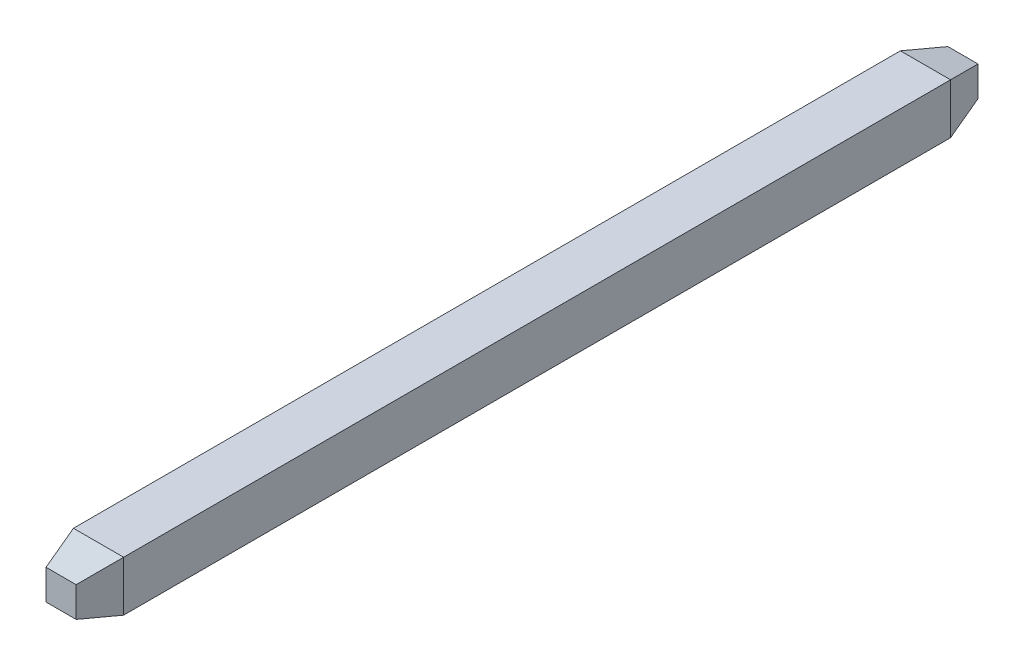
ISO-10303-21;
HEADER;
FILE_DESCRIPTION(('STEP AP214'),'2;1');
FILE_NAME('part.step','',(''),(''),'','','');
FILE_SCHEMA(('AUTOMOTIVE_DESIGN { 1 0 10303 214 1 1 1 1 }'));
ENDSEC;
DATA;
#1=APPLICATION_CONTEXT('core data for automotive mechanical design processes');
#2=APPLICATION_PROTOCOL_DEFINITION('international standard','automotive_design',2000,#1);
#3=PRODUCT_CONTEXT('',#1,'mechanical');
#4=PRODUCT('Part','Part','',(#3));
#5=PRODUCT_RELATED_PRODUCT_CATEGORY('part','',(#4));
#6=PRODUCT_DEFINITION_FORMATION('','',#4);
#7=PRODUCT_DEFINITION_CONTEXT('part definition',#1,'design');
#8=PRODUCT_DEFINITION('design','',#6,#7);
#9=PRODUCT_DEFINITION_SHAPE('','',#8);
#10=(LENGTH_UNIT() NAMED_UNIT(*) SI_UNIT(.MILLI.,.METRE.));
#11=(NAMED_UNIT(*) PLANE_ANGLE_UNIT() SI_UNIT($,.RADIAN.));
#12=(NAMED_UNIT(*) SI_UNIT($,.STERADIAN.) SOLID_ANGLE_UNIT());
#13=UNCERTAINTY_MEASURE_WITH_UNIT(LENGTH_MEASURE(1.E-05),#10,'distance_accuracy_value','');
#14=(GEOMETRIC_REPRESENTATION_CONTEXT(3) GLOBAL_UNCERTAINTY_ASSIGNED_CONTEXT((#13)) GLOBAL_UNIT_ASSIGNED_CONTEXT((#10,
#11,#12)) REPRESENTATION_CONTEXT('',''));
#15=CARTESIAN_POINT('',(0.,0.,0.));
#16=DIRECTION('',(0.,0.,1.));
#17=DIRECTION('',(1.,0.,0.));
#18=AXIS2_PLACEMENT_3D('',#15,#16,#17);
#19=CARTESIAN_POINT('',(2.86,1.00859499326234,7.92229749663118));
#20=DIRECTION('',(0.965925826289069,0.,0.25881904510252));
#21=DIRECTION('',(0.25881904510252,0.,-0.965925826289069));
#22=AXIS2_PLACEMENT_3D('',#19,#20,#21);
#23=PLANE('',#22);
#24=DIRECTION('',(0.,1.,0.));
#25=VECTOR('',#24,1.);
#26=CARTESIAN_POINT('',(2.732,2.53999999999997,8.4));
#27=LINE('',#26,#25);
#28=CARTESIAN_POINT('',(2.732,2.34799999999997,8.4));
#29=VERTEX_POINT('',#28);
#30=CARTESIAN_POINT('',(2.732,2.73199999999997,8.4));
#31=VERTEX_POINT('',#30);
#32=EDGE_CURVE('E20',#29,#31,#27,.T.);
#33=ORIENTED_EDGE('',*,*,#32,.F.);
#34=DIRECTION('',(-0.25056280708573,0.250562807085731,0.93511312653103));
#35=VECTOR('',#34,1.);
#36=CARTESIAN_POINT('',(2.86,2.21999999999997,7.92229749663118));
#37=LINE('',#36,#35);
#38=CARTESIAN_POINT('',(2.86,2.21999999999997,7.92229749663118));
#39=VERTEX_POINT('',#38);
#40=EDGE_CURVE('E110',#39,#29,#37,.T.);
#41=ORIENTED_EDGE('',*,*,#40,.F.);
#42=DIRECTION('',(0.,1.,0.));
#43=VECTOR('',#42,1.);
#44=CARTESIAN_POINT('',(2.86,2.21999999999997,7.92229749663118));
#45=LINE('',#44,#43);
#46=CARTESIAN_POINT('',(2.86,2.85999999999997,7.92229749663118));
#47=VERTEX_POINT('',#46);
#48=EDGE_CURVE('E96',#47,#39,#45,.F.);
#49=ORIENTED_EDGE('',*,*,#48,.F.);
#50=DIRECTION('',(0.25056280708573,0.250562807085731,-0.93511312653103));
#51=VECTOR('',#50,1.);
#52=CARTESIAN_POINT('',(2.732,2.73199999999997,8.4));
#53=LINE('',#52,#51);
#54=EDGE_CURVE('E94',#31,#47,#53,.T.);
#55=ORIENTED_EDGE('',*,*,#54,.F.);
#56=EDGE_LOOP('',(#33,#41,#49,#55));
#57=FACE_BOUND('',#56,.T.);
#58=ADVANCED_FACE('F17',(#57),#23,.T.);
#59=CARTESIAN_POINT('',(2.86,1.00859499326234,-2.62229749663118));
#60=DIRECTION('',(-0.965925826289068,0.,0.258819045102521));
#61=DIRECTION('',(0.258819045102521,0.,0.965925826289068));
#62=AXIS2_PLACEMENT_3D('',#59,#60,#61);
#63=PLANE('',#62);
#64=DIRECTION('',(-0.25056280708573,0.250562807085732,-0.93511312653103));
#65=VECTOR('',#64,1.);
#66=CARTESIAN_POINT('',(2.86,2.21999999999997,-2.62229749663118));
#67=LINE('',#66,#65);
#68=CARTESIAN_POINT('',(2.86,2.21999999999997,-2.62229749663118));
#69=VERTEX_POINT('',#68);
#70=CARTESIAN_POINT('',(2.732,2.34799999999997,-3.1));
#71=VERTEX_POINT('',#70);
#72=EDGE_CURVE('E113',#69,#71,#67,.T.);
#73=ORIENTED_EDGE('',*,*,#72,.T.);
#74=DIRECTION('',(0.,1.,0.));
#75=VECTOR('',#74,1.);
#76=CARTESIAN_POINT('',(2.732,2.53999999999997,-3.1));
#77=LINE('',#76,#75);
#78=CARTESIAN_POINT('',(2.732,2.73199999999997,-3.1));
#79=VERTEX_POINT('',#78);
#80=EDGE_CURVE('E79',#71,#79,#77,.T.);
#81=ORIENTED_EDGE('',*,*,#80,.T.);
#82=DIRECTION('',(0.25056280708573,0.250562807085732,0.93511312653103));
#83=VECTOR('',#82,1.);
#84=CARTESIAN_POINT('',(2.732,2.73199999999997,-3.1));
#85=LINE('',#84,#83);
#86=CARTESIAN_POINT('',(2.86,2.85999999999997,-2.62229749663118));
#87=VERTEX_POINT('',#86);
#88=EDGE_CURVE('E108',#79,#87,#85,.T.);
#89=ORIENTED_EDGE('',*,*,#88,.T.);
#90=DIRECTION('',(0.,1.,0.));
#91=VECTOR('',#90,1.);
#92=CARTESIAN_POINT('',(2.86,2.21999999999997,-2.62229749663118));
#93=LINE('',#92,#91);
#94=EDGE_CURVE('E118',#69,#87,#93,.T.);
#95=ORIENTED_EDGE('',*,*,#94,.F.);
#96=EDGE_LOOP('',(#73,#81,#89,#95));
#97=FACE_BOUND('',#96,.T.);
#98=ADVANCED_FACE('F281',(#97),#63,.F.);
#99=CARTESIAN_POINT('',(2.54,2.53999999999997,8.4));
#100=DIRECTION('',(0.,0.,1.));
#101=DIRECTION('',(1.,0.,0.));
#102=AXIS2_PLACEMENT_3D('',#99,#100,#101);
#103=PLANE('',#102);
#104=DIRECTION('',(1.,0.,0.));
#105=VECTOR('',#104,1.);
#106=CARTESIAN_POINT('',(1.00859499326237,2.34799999999997,8.4));
#107=LINE('',#106,#105);
#108=CARTESIAN_POINT('',(2.348,2.34799999999997,8.4));
#109=VERTEX_POINT('',#108);
#110=EDGE_CURVE('E90',#29,#109,#107,.F.);
#111=ORIENTED_EDGE('',*,*,#110,.F.);
#112=ORIENTED_EDGE('',*,*,#32,.T.);
#113=DIRECTION('',(1.,0.,0.));
#114=VECTOR('',#113,1.);
#115=CARTESIAN_POINT('',(4.07140500673763,2.73199999999997,8.4));
#116=LINE('',#115,#114);
#117=CARTESIAN_POINT('',(2.348,2.73199999999997,8.4));
#118=VERTEX_POINT('',#117);
#119=EDGE_CURVE('E88',#118,#31,#116,.T.);
#120=ORIENTED_EDGE('',*,*,#119,.F.);
#121=DIRECTION('',(0.,1.,0.));
#122=VECTOR('',#121,1.);
#123=CARTESIAN_POINT('',(2.348,4.0714050067376,8.4));
#124=LINE('',#123,#122);
#125=EDGE_CURVE('E124',#109,#118,#124,.T.);
#126=ORIENTED_EDGE('',*,*,#125,.F.);
#127=EDGE_LOOP('',(#111,#112,#120,#126));
#128=FACE_BOUND('',#127,.T.);
#129=ADVANCED_FACE('F85',(#128),#103,.T.);
#130=CARTESIAN_POINT('',(4.07140500673763,2.85999999999997,7.92229749663118));
#131=DIRECTION('',(0.,0.965925826289069,0.25881904510252));
#132=DIRECTION('',(0.,-0.25881904510252,0.965925826289069));
#133=AXIS2_PLACEMENT_3D('',#130,#131,#132);
#134=PLANE('',#133);
#135=ORIENTED_EDGE('',*,*,#119,.T.);
#136=ORIENTED_EDGE('',*,*,#54,.T.);
#137=DIRECTION('',(-1.,0.,0.));
#138=VECTOR('',#137,1.);
#139=CARTESIAN_POINT('',(2.86,2.85999999999997,7.92229749663118));
#140=LINE('',#139,#138);
#141=CARTESIAN_POINT('',(2.22,2.85999999999997,7.92229749663118));
#142=VERTEX_POINT('',#141);
#143=EDGE_CURVE('E127',#142,#47,#140,.F.);
#144=ORIENTED_EDGE('',*,*,#143,.F.);
#145=DIRECTION('',(-0.250562807085731,0.25056280708573,-0.93511312653103));
#146=VECTOR('',#145,1.);
#147=CARTESIAN_POINT('',(2.348,2.73199999999997,8.4));
#148=LINE('',#147,#146);
#149=EDGE_CURVE('E102',#118,#142,#148,.T.);
#150=ORIENTED_EDGE('',*,*,#149,.F.);
#151=EDGE_LOOP('',(#135,#136,#144,#150));
#152=FACE_BOUND('',#151,.T.);
#153=ADVANCED_FACE('F100',(#152),#134,.T.);
#154=CARTESIAN_POINT('',(2.54,2.53999999999997,-3.1));
#155=DIRECTION('',(0.,0.,1.));
#156=DIRECTION('',(1.,0.,0.));
#157=AXIS2_PLACEMENT_3D('',#154,#155,#156);
#158=PLANE('',#157);
#159=ORIENTED_EDGE('',*,*,#80,.F.);
#160=DIRECTION('',(1.,0.,0.));
#161=VECTOR('',#160,1.);
#162=CARTESIAN_POINT('',(1.00859499326237,2.34799999999997,-3.1));
#163=LINE('',#162,#161);
#164=CARTESIAN_POINT('',(2.348,2.34799999999997,-3.1));
#165=VERTEX_POINT('',#164);
#166=EDGE_CURVE('E115',#71,#165,#163,.F.);
#167=ORIENTED_EDGE('',*,*,#166,.T.);
#168=DIRECTION('',(0.,1.,0.));
#169=VECTOR('',#168,1.);
#170=CARTESIAN_POINT('',(2.348,4.0714050067376,-3.1));
#171=LINE('',#170,#169);
#172=CARTESIAN_POINT('',(2.348,2.73199999999997,-3.1));
#173=VERTEX_POINT('',#172);
#174=EDGE_CURVE('E138',#165,#173,#171,.T.);
#175=ORIENTED_EDGE('',*,*,#174,.T.);
#176=DIRECTION('',(1.,0.,0.));
#177=VECTOR('',#176,1.);
#178=CARTESIAN_POINT('',(4.07140500673763,2.73199999999997,-3.1));
#179=LINE('',#178,#177);
#180=EDGE_CURVE('E106',#173,#79,#179,.T.);
#181=ORIENTED_EDGE('',*,*,#180,.T.);
#182=EDGE_LOOP('',(#159,#167,#175,#181));
#183=FACE_BOUND('',#182,.T.);
#184=ADVANCED_FACE('F257',(#183),#158,.F.);
#185=CARTESIAN_POINT('',(4.07140500673763,2.85999999999997,-2.62229749663118));
#186=DIRECTION('',(0.,-0.965925826289068,0.258819045102521));
#187=DIRECTION('',(0.,-0.258819045102521,-0.965925826289068));
#188=AXIS2_PLACEMENT_3D('',#185,#186,#187);
#189=PLANE('',#188);
#190=ORIENTED_EDGE('',*,*,#88,.F.);
#191=ORIENTED_EDGE('',*,*,#180,.F.);
#192=DIRECTION('',(-0.250562807085732,0.25056280708573,0.93511312653103));
#193=VECTOR('',#192,1.);
#194=CARTESIAN_POINT('',(2.348,2.73199999999997,-3.1));
#195=LINE('',#194,#193);
#196=CARTESIAN_POINT('',(2.22,2.85999999999997,-2.62229749663118));
#197=VERTEX_POINT('',#196);
#198=EDGE_CURVE('E140',#173,#197,#195,.T.);
#199=ORIENTED_EDGE('',*,*,#198,.T.);
#200=DIRECTION('',(-1.,0.,0.));
#201=VECTOR('',#200,1.);
#202=CARTESIAN_POINT('',(2.86,2.85999999999997,-2.62229749663118));
#203=LINE('',#202,#201);
#204=EDGE_CURVE('E133',#87,#197,#203,.T.);
#205=ORIENTED_EDGE('',*,*,#204,.F.);
#206=EDGE_LOOP('',(#190,#191,#199,#205));
#207=FACE_BOUND('',#206,.T.);
#208=ADVANCED_FACE('F249',(#207),#189,.F.);
#209=CARTESIAN_POINT('',(1.00859499326237,2.21999999999997,7.92229749663118));
#210=DIRECTION('',(0.,-0.965925826289069,0.25881904510252));
#211=DIRECTION('',(0.,-0.25881904510252,-0.965925826289069));
#212=AXIS2_PLACEMENT_3D('',#209,#210,#211);
#213=PLANE('',#212);
#214=ORIENTED_EDGE('',*,*,#110,.T.);
#215=DIRECTION('',(0.250562807085731,0.25056280708573,0.93511312653103));
#216=VECTOR('',#215,1.);
#217=CARTESIAN_POINT('',(2.22,2.21999999999997,7.92229749663118));
#218=LINE('',#217,#216);
#219=CARTESIAN_POINT('',(2.22,2.21999999999997,7.92229749663118));
#220=VERTEX_POINT('',#219);
#221=EDGE_CURVE('E121',#220,#109,#218,.T.);
#222=ORIENTED_EDGE('',*,*,#221,.F.);
#223=DIRECTION('',(1.,0.,0.));
#224=VECTOR('',#223,1.);
#225=CARTESIAN_POINT('',(2.22,2.21999999999997,7.92229749663118));
#226=LINE('',#225,#224);
#227=EDGE_CURVE('E142',#39,#220,#226,.F.);
#228=ORIENTED_EDGE('',*,*,#227,.F.);
#229=ORIENTED_EDGE('',*,*,#40,.T.);
#230=EDGE_LOOP('',(#214,#222,#228,#229));
#231=FACE_BOUND('',#230,.T.);
#232=ADVANCED_FACE('F171',(#231),#213,.T.);
#233=CARTESIAN_POINT('',(1.00859499326237,2.21999999999997,-2.62229749663118));
#234=DIRECTION('',(0.,0.965925826289068,0.258819045102521));
#235=DIRECTION('',(0.,-0.258819045102521,0.965925826289068));
#236=AXIS2_PLACEMENT_3D('',#233,#234,#235);
#237=PLANE('',#236);
#238=DIRECTION('',(0.250562807085732,0.250562807085731,-0.935113126531029));
#239=VECTOR('',#238,1.);
#240=CARTESIAN_POINT('',(2.22,2.21999999999997,-2.62229749663118));
#241=LINE('',#240,#239);
#242=CARTESIAN_POINT('',(2.22,2.21999999999997,-2.62229749663118));
#243=VERTEX_POINT('',#242);
#244=EDGE_CURVE('E136',#243,#165,#241,.T.);
#245=ORIENTED_EDGE('',*,*,#244,.T.);
#246=ORIENTED_EDGE('',*,*,#166,.F.);
#247=ORIENTED_EDGE('',*,*,#72,.F.);
#248=DIRECTION('',(1.,0.,0.));
#249=VECTOR('',#248,1.);
#250=CARTESIAN_POINT('',(2.22,2.21999999999997,-2.62229749663118));
#251=LINE('',#250,#249);
#252=EDGE_CURVE('E35',#243,#69,#251,.T.);
#253=ORIENTED_EDGE('',*,*,#252,.F.);
#254=EDGE_LOOP('',(#245,#246,#247,#253));
#255=FACE_BOUND('',#254,.T.);
#256=ADVANCED_FACE('F188',(#255),#237,.F.);
#257=CARTESIAN_POINT('',(2.86,2.21999999999997,-3.1));
#258=DIRECTION('',(1.,0.,0.));
#259=DIRECTION('',(0.,1.,0.));
#260=AXIS2_PLACEMENT_3D('',#257,#258,#259);
#261=PLANE('',#260);
#262=ORIENTED_EDGE('',*,*,#94,.T.);
#263=DIRECTION('',(0.,0.,1.));
#264=VECTOR('',#263,1.);
#265=CARTESIAN_POINT('',(2.86,2.85999999999997,-3.1));
#266=LINE('',#265,#264);
#267=EDGE_CURVE('E130',#47,#87,#266,.F.);
#268=ORIENTED_EDGE('',*,*,#267,.F.);
#269=ORIENTED_EDGE('',*,*,#48,.T.);
#270=DIRECTION('',(0.,0.,1.));
#271=VECTOR('',#270,1.);
#272=CARTESIAN_POINT('',(2.86,2.21999999999997,-3.1));
#273=LINE('',#272,#271);
#274=EDGE_CURVE('E146',#69,#39,#273,.T.);
#275=ORIENTED_EDGE('',*,*,#274,.F.);
#276=EDGE_LOOP('',(#262,#268,#269,#275));
#277=FACE_BOUND('',#276,.T.);
#278=ADVANCED_FACE('F174',(#277),#261,.T.);
#279=CARTESIAN_POINT('',(2.22,4.0714050067376,7.92229749663118));
#280=DIRECTION('',(-0.965925826289069,0.,0.25881904510252));
#281=DIRECTION('',(0.25881904510252,0.,0.965925826289069));
#282=AXIS2_PLACEMENT_3D('',#279,#280,#281);
#283=PLANE('',#282);
#284=ORIENTED_EDGE('',*,*,#125,.T.);
#285=ORIENTED_EDGE('',*,*,#149,.T.);
#286=DIRECTION('',(0.,-1.,0.));
#287=VECTOR('',#286,1.);
#288=CARTESIAN_POINT('',(2.22,2.85999999999997,7.92229749663118));
#289=LINE('',#288,#287);
#290=EDGE_CURVE('E149',#220,#142,#289,.F.);
#291=ORIENTED_EDGE('',*,*,#290,.F.);
#292=ORIENTED_EDGE('',*,*,#221,.T.);
#293=EDGE_LOOP('',(#284,#285,#291,#292));
#294=FACE_BOUND('',#293,.T.);
#295=ADVANCED_FACE('F179',(#294),#283,.T.);
#296=CARTESIAN_POINT('',(2.86,2.85999999999997,-3.1));
#297=DIRECTION('',(0.,1.,0.));
#298=DIRECTION('',(-1.,0.,0.));
#299=AXIS2_PLACEMENT_3D('',#296,#297,#298);
#300=PLANE('',#299);
#301=ORIENTED_EDGE('',*,*,#204,.T.);
#302=DIRECTION('',(0.,0.,1.));
#303=VECTOR('',#302,1.);
#304=CARTESIAN_POINT('',(2.22,2.85999999999997,-3.1));
#305=LINE('',#304,#303);
#306=EDGE_CURVE('E152',#142,#197,#305,.F.);
#307=ORIENTED_EDGE('',*,*,#306,.F.);
#308=ORIENTED_EDGE('',*,*,#143,.T.);
#309=ORIENTED_EDGE('',*,*,#267,.T.);
#310=EDGE_LOOP('',(#301,#307,#308,#309));
#311=FACE_BOUND('',#310,.T.);
#312=ADVANCED_FACE('F177',(#311),#300,.T.);
#313=CARTESIAN_POINT('',(2.22,4.0714050067376,-2.62229749663118));
#314=DIRECTION('',(0.965925826289068,0.,0.258819045102521));
#315=DIRECTION('',(0.258819045102521,0.,-0.965925826289068));
#316=AXIS2_PLACEMENT_3D('',#313,#314,#315);
#317=PLANE('',#316);
#318=ORIENTED_EDGE('',*,*,#198,.F.);
#319=ORIENTED_EDGE('',*,*,#174,.F.);
#320=ORIENTED_EDGE('',*,*,#244,.F.);
#321=DIRECTION('',(0.,-1.,0.));
#322=VECTOR('',#321,1.);
#323=CARTESIAN_POINT('',(2.22,2.85999999999997,-2.62229749663118));
#324=LINE('',#323,#322);
#325=EDGE_CURVE('E26',#197,#243,#324,.T.);
#326=ORIENTED_EDGE('',*,*,#325,.F.);
#327=EDGE_LOOP('',(#318,#319,#320,#326));
#328=FACE_BOUND('',#327,.T.);
#329=ADVANCED_FACE('F163',(#328),#317,.F.);
#330=CARTESIAN_POINT('',(2.22,2.21999999999997,-3.1));
#331=DIRECTION('',(0.,-1.,0.));
#332=DIRECTION('',(1.,0.,0.));
#333=AXIS2_PLACEMENT_3D('',#330,#331,#332);
#334=PLANE('',#333);
#335=ORIENTED_EDGE('',*,*,#252,.T.);
#336=ORIENTED_EDGE('',*,*,#274,.T.);
#337=ORIENTED_EDGE('',*,*,#227,.T.);
#338=DIRECTION('',(0.,0.,1.));
#339=VECTOR('',#338,1.);
#340=CARTESIAN_POINT('',(2.22,2.21999999999997,-3.1));
#341=LINE('',#340,#339);
#342=EDGE_CURVE('E11',#243,#220,#341,.T.);
#343=ORIENTED_EDGE('',*,*,#342,.F.);
#344=EDGE_LOOP('',(#335,#336,#337,#343));
#345=FACE_BOUND('',#344,.T.);
#346=ADVANCED_FACE('F167',(#345),#334,.T.);
#347=CARTESIAN_POINT('',(2.22,2.85999999999997,-3.1));
#348=DIRECTION('',(-1.,0.,0.));
#349=DIRECTION('',(0.,-1.,0.));
#350=AXIS2_PLACEMENT_3D('',#347,#348,#349);
#351=PLANE('',#350);
#352=ORIENTED_EDGE('',*,*,#325,.T.);
#353=ORIENTED_EDGE('',*,*,#342,.T.);
#354=ORIENTED_EDGE('',*,*,#290,.T.);
#355=ORIENTED_EDGE('',*,*,#306,.T.);
#356=EDGE_LOOP('',(#352,#353,#354,#355));
#357=FACE_BOUND('',#356,.T.);
#358=ADVANCED_FACE('F158',(#357),#351,.T.);
#359=CLOSED_SHELL('',(#58,#98,#129,#153,#184,#208,#232,#256,#278,#295,#312,#329,#346,#358));
#360=MANIFOLD_SOLID_BREP('B1',#359);
#361=ADVANCED_BREP_SHAPE_REPRESENTATION('',(#18,#360),#14);
#362=SHAPE_DEFINITION_REPRESENTATION(#9,#361);
ENDSEC;
END-ISO-10303-21;
